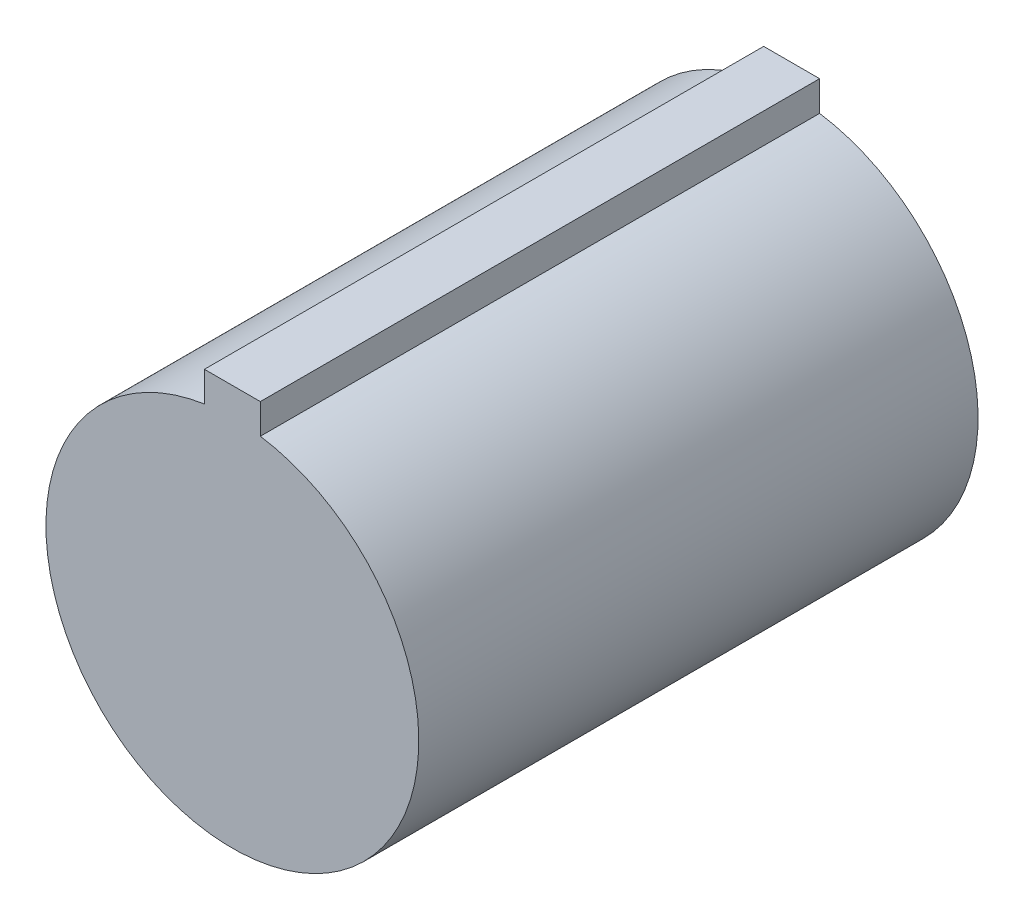
ISO-10303-21;
HEADER;
FILE_DESCRIPTION(('STEP AP214'),'2;1');
FILE_NAME('part.step','',(''),(''),'','','');
FILE_SCHEMA(('AUTOMOTIVE_DESIGN { 1 0 10303 214 1 1 1 1 }'));
ENDSEC;
DATA;
#1=APPLICATION_CONTEXT('core data for automotive mechanical design processes');
#2=APPLICATION_PROTOCOL_DEFINITION('international standard','automotive_design',2000,#1);
#3=PRODUCT_CONTEXT('',#1,'mechanical');
#4=PRODUCT('Part','Part','',(#3));
#5=PRODUCT_RELATED_PRODUCT_CATEGORY('part','',(#4));
#6=PRODUCT_DEFINITION_FORMATION('','',#4);
#7=PRODUCT_DEFINITION_CONTEXT('part definition',#1,'design');
#8=PRODUCT_DEFINITION('design','',#6,#7);
#9=PRODUCT_DEFINITION_SHAPE('','',#8);
#10=(LENGTH_UNIT() NAMED_UNIT(*) SI_UNIT(.MILLI.,.METRE.));
#11=(NAMED_UNIT(*) PLANE_ANGLE_UNIT() SI_UNIT($,.RADIAN.));
#12=(NAMED_UNIT(*) SI_UNIT($,.STERADIAN.) SOLID_ANGLE_UNIT());
#13=UNCERTAINTY_MEASURE_WITH_UNIT(LENGTH_MEASURE(1.E-05),#10,'distance_accuracy_value','');
#14=(GEOMETRIC_REPRESENTATION_CONTEXT(3) GLOBAL_UNCERTAINTY_ASSIGNED_CONTEXT((#13)) GLOBAL_UNIT_ASSIGNED_CONTEXT((#10,
#11,#12)) REPRESENTATION_CONTEXT('',''));
#15=CARTESIAN_POINT('',(0.,0.,0.));
#16=DIRECTION('',(0.,0.,1.));
#17=DIRECTION('',(1.,0.,0.));
#18=AXIS2_PLACEMENT_3D('',#15,#16,#17);
#19=CARTESIAN_POINT('',(0.,0.,76.2));
#20=DIRECTION('',(0.,0.,-1.));
#21=DIRECTION('',(-1.,0.,0.));
#22=AXIS2_PLACEMENT_3D('',#19,#20,#21);
#23=CYLINDRICAL_SURFACE('',#22,50.8);
#24=CARTESIAN_POINT('',(0.,0.,76.2));
#25=DIRECTION('',(0.,0.,1.));
#26=DIRECTION('',(1.,0.,0.));
#27=AXIS2_PLACEMENT_3D('',#24,#25,#26);
#28=CIRCLE('',#27,50.8);
#29=CARTESIAN_POINT('',(-7.62,50.2252486305444,76.2));
#30=VERTEX_POINT('',#29);
#31=CARTESIAN_POINT('',(7.62,50.2252486305444,76.2));
#32=VERTEX_POINT('',#31);
#33=EDGE_CURVE('E11',#30,#32,#28,.T.);
#34=ORIENTED_EDGE('',*,*,#33,.F.);
#35=DIRECTION('',(0.,0.,1.));
#36=VECTOR('',#35,1.);
#37=CARTESIAN_POINT('',(-7.62,50.2252486305444,-76.2));
#38=LINE('',#37,#36);
#39=CARTESIAN_POINT('',(-7.62,50.2252486305444,-76.2));
#40=VERTEX_POINT('',#39);
#41=EDGE_CURVE('E78',#40,#30,#38,.T.);
#42=ORIENTED_EDGE('',*,*,#41,.F.);
#43=CARTESIAN_POINT('',(0.,0.,-76.2));
#44=DIRECTION('',(0.,0.,1.));
#45=DIRECTION('',(1.,0.,0.));
#46=AXIS2_PLACEMENT_3D('',#43,#44,#45);
#47=CIRCLE('',#46,50.8);
#48=CARTESIAN_POINT('',(7.62,50.2252486305444,-76.2));
#49=VERTEX_POINT('',#48);
#50=EDGE_CURVE('E36',#40,#49,#47,.T.);
#51=ORIENTED_EDGE('',*,*,#50,.T.);
#52=DIRECTION('',(0.,0.,1.));
#53=VECTOR('',#52,1.);
#54=CARTESIAN_POINT('',(7.62,50.2252486305444,-76.2));
#55=LINE('',#54,#53);
#56=EDGE_CURVE('E50',#49,#32,#55,.T.);
#57=ORIENTED_EDGE('',*,*,#56,.T.);
#58=EDGE_LOOP('',(#34,#42,#51,#57));
#59=FACE_BOUND('',#58,.T.);
#60=ADVANCED_FACE('F33',(#59),#23,.T.);
#61=CARTESIAN_POINT('',(0.,0.,76.2));
#62=DIRECTION('',(0.,0.,1.));
#63=DIRECTION('',(1.,0.,0.));
#64=AXIS2_PLACEMENT_3D('',#61,#62,#63);
#65=PLANE('',#64);
#66=ORIENTED_EDGE('',*,*,#33,.T.);
#67=DIRECTION('',(0.,1.,0.));
#68=VECTOR('',#67,1.);
#69=CARTESIAN_POINT('',(7.62,50.2252486305444,76.2));
#70=LINE('',#69,#68);
#71=CARTESIAN_POINT('',(7.62,58.42,76.2));
#72=VERTEX_POINT('',#71);
#73=EDGE_CURVE('E89',#32,#72,#70,.T.);
#74=ORIENTED_EDGE('',*,*,#73,.T.);
#75=DIRECTION('',(-1.,0.,0.));
#76=VECTOR('',#75,1.);
#77=CARTESIAN_POINT('',(7.62,58.42,76.2));
#78=LINE('',#77,#76);
#79=CARTESIAN_POINT('',(-7.62,58.42,76.2));
#80=VERTEX_POINT('',#79);
#81=EDGE_CURVE('E85',#72,#80,#78,.T.);
#82=ORIENTED_EDGE('',*,*,#81,.T.);
#83=DIRECTION('',(0.,-1.,0.));
#84=VECTOR('',#83,1.);
#85=CARTESIAN_POINT('',(-7.62,50.2252486305444,76.2));
#86=LINE('',#85,#84);
#87=EDGE_CURVE('E93',#80,#30,#86,.T.);
#88=ORIENTED_EDGE('',*,*,#87,.T.);
#89=EDGE_LOOP('',(#66,#74,#82,#88));
#90=FACE_BOUND('',#89,.T.);
#91=ADVANCED_FACE('F106',(#90),#65,.T.);
#92=CARTESIAN_POINT('',(0.,0.,-76.2));
#93=DIRECTION('',(0.,0.,1.));
#94=DIRECTION('',(1.,0.,0.));
#95=AXIS2_PLACEMENT_3D('',#92,#93,#94);
#96=PLANE('',#95);
#97=ORIENTED_EDGE('',*,*,#50,.F.);
#98=DIRECTION('',(0.,-1.,0.));
#99=VECTOR('',#98,1.);
#100=CARTESIAN_POINT('',(-7.62,50.2252486305444,-76.2));
#101=LINE('',#100,#99);
#102=CARTESIAN_POINT('',(-7.62,58.42,-76.2));
#103=VERTEX_POINT('',#102);
#104=EDGE_CURVE('E73',#103,#40,#101,.T.);
#105=ORIENTED_EDGE('',*,*,#104,.F.);
#106=DIRECTION('',(-1.,0.,0.));
#107=VECTOR('',#106,1.);
#108=CARTESIAN_POINT('',(7.62,58.42,-76.2));
#109=LINE('',#108,#107);
#110=CARTESIAN_POINT('',(7.62,58.42,-76.2));
#111=VERTEX_POINT('',#110);
#112=EDGE_CURVE('E82',#111,#103,#109,.T.);
#113=ORIENTED_EDGE('',*,*,#112,.F.);
#114=DIRECTION('',(0.,1.,0.));
#115=VECTOR('',#114,1.);
#116=CARTESIAN_POINT('',(7.62,50.2252486305444,-76.2));
#117=LINE('',#116,#115);
#118=EDGE_CURVE('E76',#49,#111,#117,.T.);
#119=ORIENTED_EDGE('',*,*,#118,.F.);
#120=EDGE_LOOP('',(#97,#105,#113,#119));
#121=FACE_BOUND('',#120,.T.);
#122=ADVANCED_FACE('F70',(#121),#96,.F.);
#123=CARTESIAN_POINT('',(-7.62,50.2252486305444,-76.2));
#124=DIRECTION('',(-1.,0.,0.));
#125=DIRECTION('',(0.,0.,1.));
#126=AXIS2_PLACEMENT_3D('',#123,#124,#125);
#127=PLANE('',#126);
#128=ORIENTED_EDGE('',*,*,#87,.F.);
#129=DIRECTION('',(0.,0.,1.));
#130=VECTOR('',#129,1.);
#131=CARTESIAN_POINT('',(-7.62,58.42,-76.2));
#132=LINE('',#131,#130);
#133=EDGE_CURVE('E77',#103,#80,#132,.T.);
#134=ORIENTED_EDGE('',*,*,#133,.F.);
#135=ORIENTED_EDGE('',*,*,#104,.T.);
#136=ORIENTED_EDGE('',*,*,#41,.T.);
#137=EDGE_LOOP('',(#128,#134,#135,#136));
#138=FACE_BOUND('',#137,.T.);
#139=ADVANCED_FACE('F84',(#138),#127,.T.);
#140=CARTESIAN_POINT('',(7.62,58.42,-76.2));
#141=DIRECTION('',(0.,1.,0.));
#142=DIRECTION('',(0.,0.,1.));
#143=AXIS2_PLACEMENT_3D('',#140,#141,#142);
#144=PLANE('',#143);
#145=ORIENTED_EDGE('',*,*,#81,.F.);
#146=DIRECTION('',(0.,0.,1.));
#147=VECTOR('',#146,1.);
#148=CARTESIAN_POINT('',(7.62,58.42,-76.2));
#149=LINE('',#148,#147);
#150=EDGE_CURVE('E98',#111,#72,#149,.T.);
#151=ORIENTED_EDGE('',*,*,#150,.F.);
#152=ORIENTED_EDGE('',*,*,#112,.T.);
#153=ORIENTED_EDGE('',*,*,#133,.T.);
#154=EDGE_LOOP('',(#145,#151,#152,#153));
#155=FACE_BOUND('',#154,.T.);
#156=ADVANCED_FACE('F107',(#155),#144,.T.);
#157=CARTESIAN_POINT('',(7.62,50.2252486305444,-76.2));
#158=DIRECTION('',(1.,0.,0.));
#159=DIRECTION('',(0.,0.,-1.));
#160=AXIS2_PLACEMENT_3D('',#157,#158,#159);
#161=PLANE('',#160);
#162=ORIENTED_EDGE('',*,*,#73,.F.);
#163=ORIENTED_EDGE('',*,*,#56,.F.);
#164=ORIENTED_EDGE('',*,*,#118,.T.);
#165=ORIENTED_EDGE('',*,*,#150,.T.);
#166=EDGE_LOOP('',(#162,#163,#164,#165));
#167=FACE_BOUND('',#166,.T.);
#168=ADVANCED_FACE('F102',(#167),#161,.T.);
#169=CLOSED_SHELL('',(#60,#91,#122,#139,#156,#168));
#170=MANIFOLD_SOLID_BREP('B2',#169);
#171=ADVANCED_BREP_SHAPE_REPRESENTATION('',(#18,#170),#14);
#172=SHAPE_DEFINITION_REPRESENTATION(#9,#171);
ENDSEC;
END-ISO-10303-21;
